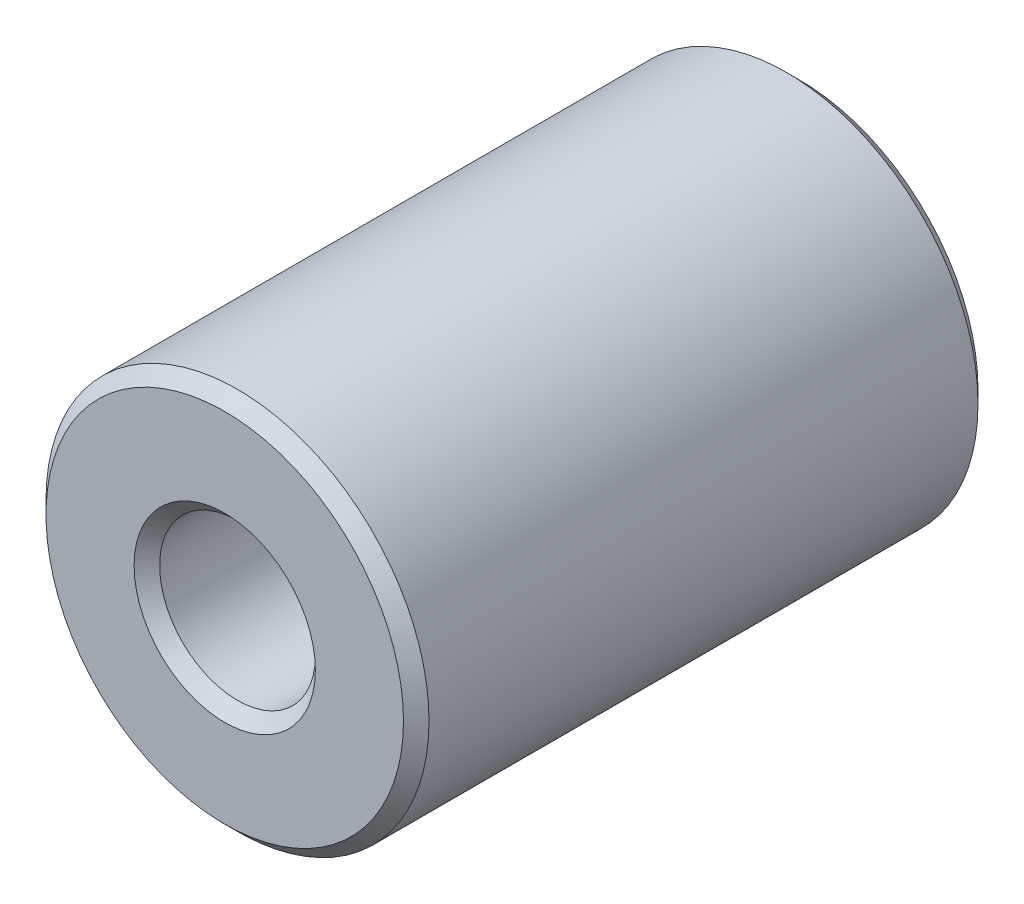
ISO-10303-21;
HEADER;
FILE_DESCRIPTION(('STEP AP214'),'2;1');
FILE_NAME('part.step','',(''),(''),'','','');
FILE_SCHEMA(('AUTOMOTIVE_DESIGN { 1 0 10303 214 1 1 1 1 }'));
ENDSEC;
DATA;
#1=APPLICATION_CONTEXT('core data for automotive mechanical design processes');
#2=APPLICATION_PROTOCOL_DEFINITION('international standard','automotive_design',2000,#1);
#3=PRODUCT_CONTEXT('',#1,'mechanical');
#4=PRODUCT('Part','Part','',(#3));
#5=PRODUCT_RELATED_PRODUCT_CATEGORY('part','',(#4));
#6=PRODUCT_DEFINITION_FORMATION('','',#4);
#7=PRODUCT_DEFINITION_CONTEXT('part definition',#1,'design');
#8=PRODUCT_DEFINITION('design','',#6,#7);
#9=PRODUCT_DEFINITION_SHAPE('','',#8);
#10=(LENGTH_UNIT() NAMED_UNIT(*) SI_UNIT(.MILLI.,.METRE.));
#11=(NAMED_UNIT(*) PLANE_ANGLE_UNIT() SI_UNIT($,.RADIAN.));
#12=(NAMED_UNIT(*) SI_UNIT($,.STERADIAN.) SOLID_ANGLE_UNIT());
#13=UNCERTAINTY_MEASURE_WITH_UNIT(LENGTH_MEASURE(1.E-05),#10,'distance_accuracy_value','');
#14=(GEOMETRIC_REPRESENTATION_CONTEXT(3) GLOBAL_UNCERTAINTY_ASSIGNED_CONTEXT((#13)) GLOBAL_UNIT_ASSIGNED_CONTEXT((#10,
#11,#12)) REPRESENTATION_CONTEXT('',''));
#15=CARTESIAN_POINT('',(0.,0.,0.));
#16=DIRECTION('',(0.,0.,1.));
#17=DIRECTION('',(1.,0.,0.));
#18=AXIS2_PLACEMENT_3D('',#15,#16,#17);
#19=CARTESIAN_POINT('',(0.,0.,45.));
#20=DIRECTION('',(0.,0.,1.));
#21=DIRECTION('',(1.,0.,0.));
#22=AXIS2_PLACEMENT_3D('',#19,#20,#21);
#23=PLANE('',#22);
#24=CARTESIAN_POINT('',(0.,0.,45.));
#25=DIRECTION('',(0.,0.,1.));
#26=DIRECTION('',(1.,0.,0.));
#27=AXIS2_PLACEMENT_3D('',#24,#25,#26);
#28=CIRCLE('',#27,14.);
#29=CARTESIAN_POINT('',(14.,0.,45.));
#30=VERTEX_POINT('',#29);
#31=EDGE_CURVE('E41',#30,#30,#28,.T.);
#32=ORIENTED_EDGE('',*,*,#31,.T.);
#33=EDGE_LOOP('',(#32));
#34=FACE_BOUND('',#33,.T.);
#35=CARTESIAN_POINT('',(0.,0.,45.));
#36=DIRECTION('',(0.,0.,1.));
#37=DIRECTION('',(1.,0.,0.));
#38=AXIS2_PLACEMENT_3D('',#35,#36,#37);
#39=CIRCLE('',#38,7.10000000000004);
#40=CARTESIAN_POINT('',(7.10000000000004,0.,45.));
#41=VERTEX_POINT('',#40);
#42=EDGE_CURVE('E45',#41,#41,#39,.F.);
#43=ORIENTED_EDGE('',*,*,#42,.T.);
#44=EDGE_LOOP('',(#43));
#45=FACE_BOUND('',#44,.T.);
#46=ADVANCED_FACE('F30',(#34,#45),#23,.T.);
#47=CARTESIAN_POINT('',(0.,0.,0.));
#48=DIRECTION('',(0.,0.,1.));
#49=DIRECTION('',(1.,0.,0.));
#50=AXIS2_PLACEMENT_3D('',#47,#48,#49);
#51=PLANE('',#50);
#52=CARTESIAN_POINT('',(0.,0.,0.));
#53=DIRECTION('',(0.,0.,1.));
#54=DIRECTION('',(1.,0.,0.));
#55=AXIS2_PLACEMENT_3D('',#52,#53,#54);
#56=CIRCLE('',#55,14.);
#57=CARTESIAN_POINT('',(14.,0.,0.));
#58=VERTEX_POINT('',#57);
#59=EDGE_CURVE('E50',#58,#58,#56,.F.);
#60=ORIENTED_EDGE('',*,*,#59,.T.);
#61=EDGE_LOOP('',(#60));
#62=FACE_BOUND('',#61,.T.);
#63=CARTESIAN_POINT('',(0.,0.,0.));
#64=DIRECTION('',(0.,0.,1.));
#65=DIRECTION('',(1.,0.,0.));
#66=AXIS2_PLACEMENT_3D('',#63,#64,#65);
#67=CIRCLE('',#66,7.09999999999998);
#68=CARTESIAN_POINT('',(7.09999999999998,0.,0.));
#69=VERTEX_POINT('',#68);
#70=EDGE_CURVE('E53',#69,#69,#67,.T.);
#71=ORIENTED_EDGE('',*,*,#70,.T.);
#72=EDGE_LOOP('',(#71));
#73=FACE_BOUND('',#72,.T.);
#74=ADVANCED_FACE('F75',(#62,#73),#51,.F.);
#75=CARTESIAN_POINT('',(0.,0.,45.));
#76=DIRECTION('',(0.,0.,-1.));
#77=DIRECTION('',(-1.,0.,0.));
#78=AXIS2_PLACEMENT_3D('',#75,#76,#77);
#79=CYLINDRICAL_SURFACE('',#78,15.);
#80=CARTESIAN_POINT('',(0.,0.,1.00000000000003));
#81=DIRECTION('',(0.,0.,1.));
#82=DIRECTION('',(1.,0.,0.));
#83=AXIS2_PLACEMENT_3D('',#80,#81,#82);
#84=CIRCLE('',#83,15.);
#85=CARTESIAN_POINT('',(15.,0.,1.00000000000003));
#86=VERTEX_POINT('',#85);
#87=EDGE_CURVE('E56',#86,#86,#84,.T.);
#88=ORIENTED_EDGE('',*,*,#87,.T.);
#89=EDGE_LOOP('',(#88));
#90=FACE_BOUND('',#89,.T.);
#91=CARTESIAN_POINT('',(0.,0.,44.));
#92=DIRECTION('',(0.,0.,1.));
#93=DIRECTION('',(1.,0.,0.));
#94=AXIS2_PLACEMENT_3D('',#91,#92,#93);
#95=CIRCLE('',#94,15.);
#96=CARTESIAN_POINT('',(15.,0.,44.));
#97=VERTEX_POINT('',#96);
#98=EDGE_CURVE('E59',#97,#97,#95,.F.);
#99=ORIENTED_EDGE('',*,*,#98,.T.);
#100=EDGE_LOOP('',(#99));
#101=FACE_BOUND('',#100,.T.);
#102=ADVANCED_FACE('F63',(#90,#101),#79,.T.);
#103=CARTESIAN_POINT('',(0.,0.,45.));
#104=DIRECTION('',(0.,0.,-1.));
#105=DIRECTION('',(-1.,0.,0.));
#106=AXIS2_PLACEMENT_3D('',#103,#104,#105);
#107=CYLINDRICAL_SURFACE('',#106,6.1);
#108=CARTESIAN_POINT('',(0.,0.,0.999999999999994));
#109=DIRECTION('',(0.,0.,1.));
#110=DIRECTION('',(1.,0.,0.));
#111=AXIS2_PLACEMENT_3D('',#108,#109,#110);
#112=CIRCLE('',#111,6.1);
#113=CARTESIAN_POINT('',(6.1,0.,0.999999999999994));
#114=VERTEX_POINT('',#113);
#115=EDGE_CURVE('E10',#114,#114,#112,.F.);
#116=ORIENTED_EDGE('',*,*,#115,.T.);
#117=EDGE_LOOP('',(#116));
#118=FACE_BOUND('',#117,.T.);
#119=CARTESIAN_POINT('',(0.,0.,44.));
#120=DIRECTION('',(0.,0.,1.));
#121=DIRECTION('',(1.,0.,0.));
#122=AXIS2_PLACEMENT_3D('',#119,#120,#121);
#123=CIRCLE('',#122,6.1);
#124=CARTESIAN_POINT('',(6.1,0.,44.));
#125=VERTEX_POINT('',#124);
#126=EDGE_CURVE('E37',#125,#125,#123,.T.);
#127=ORIENTED_EDGE('',*,*,#126,.T.);
#128=EDGE_LOOP('',(#127));
#129=FACE_BOUND('',#128,.T.);
#130=ADVANCED_FACE('F91',(#118,#129),#107,.F.);
#131=CARTESIAN_POINT('',(0.,0.,1.00000000000003));
#132=DIRECTION('',(0.,0.,1.));
#133=DIRECTION('',(1.,0.,0.));
#134=AXIS2_PLACEMENT_3D('',#131,#132,#133);
#135=CONICAL_SURFACE('',#134,15.,0.785398163397451);
#136=ORIENTED_EDGE('',*,*,#59,.F.);
#137=EDGE_LOOP('',(#136));
#138=FACE_BOUND('',#137,.T.);
#139=ORIENTED_EDGE('',*,*,#87,.F.);
#140=EDGE_LOOP('',(#139));
#141=FACE_BOUND('',#140,.T.);
#142=ADVANCED_FACE('F69',(#138,#141),#135,.T.);
#143=CARTESIAN_POINT('',(0.,0.,45.));
#144=DIRECTION('',(0.,0.,-1.));
#145=DIRECTION('',(-1.,0.,0.));
#146=AXIS2_PLACEMENT_3D('',#143,#144,#145);
#147=CONICAL_SURFACE('',#146,14.,0.785398163397443);
#148=ORIENTED_EDGE('',*,*,#98,.F.);
#149=EDGE_LOOP('',(#148));
#150=FACE_BOUND('',#149,.T.);
#151=ORIENTED_EDGE('',*,*,#31,.F.);
#152=EDGE_LOOP('',(#151));
#153=FACE_BOUND('',#152,.T.);
#154=ADVANCED_FACE('F65',(#150,#153),#147,.T.);
#155=CARTESIAN_POINT('',(0.,0.,0.));
#156=DIRECTION('',(0.,0.,-1.));
#157=DIRECTION('',(-1.,0.,0.));
#158=AXIS2_PLACEMENT_3D('',#155,#156,#157);
#159=CONICAL_SURFACE('',#158,7.09999999999998,0.785398163397442);
#160=ORIENTED_EDGE('',*,*,#115,.F.);
#161=EDGE_LOOP('',(#160));
#162=FACE_BOUND('',#161,.T.);
#163=ORIENTED_EDGE('',*,*,#70,.F.);
#164=EDGE_LOOP('',(#163));
#165=FACE_BOUND('',#164,.T.);
#166=ADVANCED_FACE('F68',(#162,#165),#159,.F.);
#167=CARTESIAN_POINT('',(0.,0.,44.));
#168=DIRECTION('',(0.,0.,1.));
#169=DIRECTION('',(1.,0.,0.));
#170=AXIS2_PLACEMENT_3D('',#167,#168,#169);
#171=CONICAL_SURFACE('',#170,6.1,0.785398163397455);
#172=ORIENTED_EDGE('',*,*,#42,.F.);
#173=EDGE_LOOP('',(#172));
#174=FACE_BOUND('',#173,.T.);
#175=ORIENTED_EDGE('',*,*,#126,.F.);
#176=EDGE_LOOP('',(#175));
#177=FACE_BOUND('',#176,.T.);
#178=ADVANCED_FACE('F32',(#174,#177),#171,.F.);
#179=CLOSED_SHELL('',(#46,#74,#102,#130,#142,#154,#166,#178));
#180=MANIFOLD_SOLID_BREP('B2',#179);
#181=ADVANCED_BREP_SHAPE_REPRESENTATION('',(#18,#180),#14);
#182=SHAPE_DEFINITION_REPRESENTATION(#9,#181);
ENDSEC;
END-ISO-10303-21;
